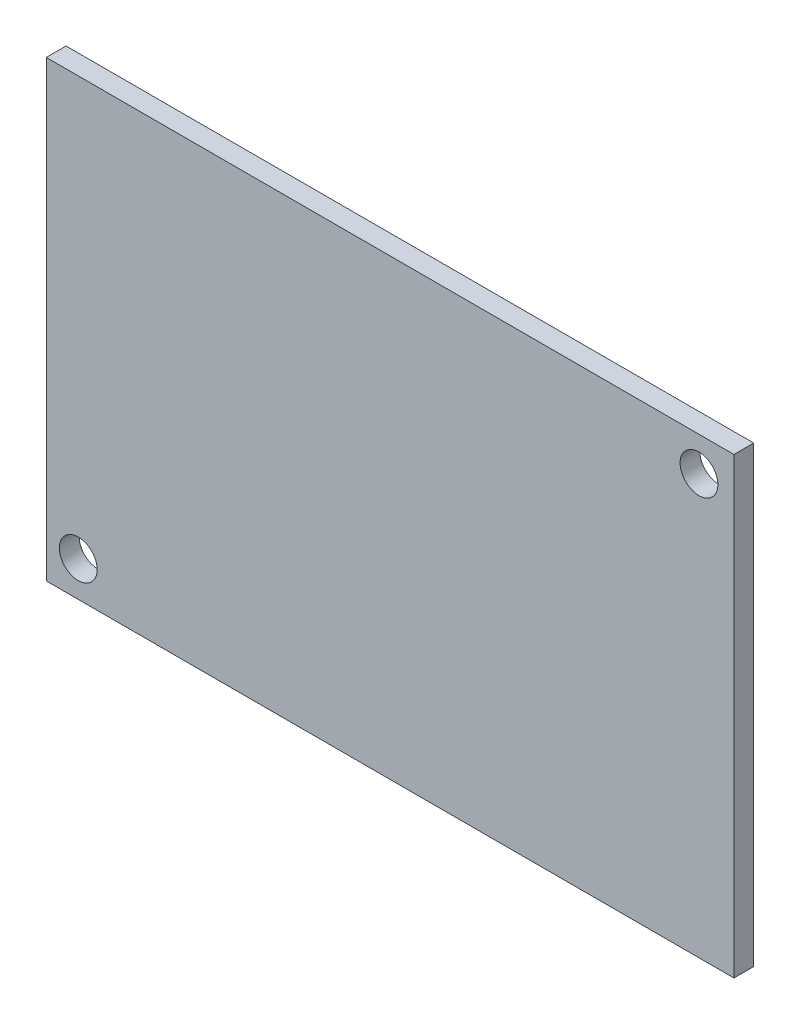
ISO-10303-21;
HEADER;
FILE_DESCRIPTION(('STEP AP214'),'2;1');
FILE_NAME('part.step','',(''),(''),'','','');
FILE_SCHEMA(('AUTOMOTIVE_DESIGN { 1 0 10303 214 1 1 1 1 }'));
ENDSEC;
DATA;
#1=APPLICATION_CONTEXT('core data for automotive mechanical design processes');
#2=APPLICATION_PROTOCOL_DEFINITION('international standard','automotive_design',2000,#1);
#3=PRODUCT_CONTEXT('',#1,'mechanical');
#4=PRODUCT('Part','Part','',(#3));
#5=PRODUCT_RELATED_PRODUCT_CATEGORY('part','',(#4));
#6=PRODUCT_DEFINITION_FORMATION('','',#4);
#7=PRODUCT_DEFINITION_CONTEXT('part definition',#1,'design');
#8=PRODUCT_DEFINITION('design','',#6,#7);
#9=PRODUCT_DEFINITION_SHAPE('','',#8);
#10=(LENGTH_UNIT() NAMED_UNIT(*) SI_UNIT(.MILLI.,.METRE.));
#11=(NAMED_UNIT(*) PLANE_ANGLE_UNIT() SI_UNIT($,.RADIAN.));
#12=(NAMED_UNIT(*) SI_UNIT($,.STERADIAN.) SOLID_ANGLE_UNIT());
#13=UNCERTAINTY_MEASURE_WITH_UNIT(LENGTH_MEASURE(1.E-05),#10,'distance_accuracy_value','');
#14=(GEOMETRIC_REPRESENTATION_CONTEXT(3) GLOBAL_UNCERTAINTY_ASSIGNED_CONTEXT((#13)) GLOBAL_UNIT_ASSIGNED_CONTEXT((#10,
#11,#12)) REPRESENTATION_CONTEXT('',''));
#15=CARTESIAN_POINT('',(0.,0.,0.));
#16=DIRECTION('',(0.,0.,1.));
#17=DIRECTION('',(1.,0.,0.));
#18=AXIS2_PLACEMENT_3D('',#15,#16,#17);
#19=CARTESIAN_POINT('',(0.762,0.,1.57));
#20=DIRECTION('',(0.,0.,-1.));
#21=DIRECTION('',(-1.,0.,0.));
#22=AXIS2_PLACEMENT_3D('',#19,#20,#21);
#23=PLANE('',#22);
#24=CARTESIAN_POINT('',(52.578,33.274,1.57));
#25=DIRECTION('',(0.,0.,-1.));
#26=DIRECTION('',(-1.,0.,0.));
#27=AXIS2_PLACEMENT_3D('',#24,#25,#26);
#28=CIRCLE('',#27,1.5);
#29=CARTESIAN_POINT('',(51.078,33.274,1.57));
#30=VERTEX_POINT('',#29);
#31=EDGE_CURVE('E84',#30,#30,#28,.T.);
#32=ORIENTED_EDGE('',*,*,#31,.T.);
#33=EDGE_LOOP('',(#32));
#34=FACE_BOUND('',#33,.T.);
#35=CARTESIAN_POINT('',(3.302,2.794,1.57));
#36=DIRECTION('',(0.,0.,-1.));
#37=DIRECTION('',(-1.,0.,0.));
#38=AXIS2_PLACEMENT_3D('',#35,#36,#37);
#39=CIRCLE('',#38,1.5);
#40=CARTESIAN_POINT('',(1.802,2.794,1.57));
#41=VERTEX_POINT('',#40);
#42=EDGE_CURVE('E20',#41,#41,#39,.T.);
#43=ORIENTED_EDGE('',*,*,#42,.T.);
#44=EDGE_LOOP('',(#43));
#45=FACE_BOUND('',#44,.T.);
#46=DIRECTION('',(0.,1.,0.));
#47=VECTOR('',#46,1.);
#48=CARTESIAN_POINT('',(55.352,0.,1.57));
#49=LINE('',#48,#47);
#50=CARTESIAN_POINT('',(55.352,0.,1.57));
#51=VERTEX_POINT('',#50);
#52=CARTESIAN_POINT('',(55.352,35.992,1.57));
#53=VERTEX_POINT('',#52);
#54=EDGE_CURVE('E55',#51,#53,#49,.T.);
#55=ORIENTED_EDGE('',*,*,#54,.T.);
#56=DIRECTION('',(1.,0.,0.));
#57=VECTOR('',#56,1.);
#58=CARTESIAN_POINT('',(55.352,35.992,1.57));
#59=LINE('',#58,#57);
#60=CARTESIAN_POINT('',(0.762,35.992,1.57));
#61=VERTEX_POINT('',#60);
#62=EDGE_CURVE('E57',#53,#61,#59,.F.);
#63=ORIENTED_EDGE('',*,*,#62,.T.);
#64=DIRECTION('',(0.,1.,0.));
#65=VECTOR('',#64,1.);
#66=CARTESIAN_POINT('',(0.762,35.992,1.57));
#67=LINE('',#66,#65);
#68=CARTESIAN_POINT('',(0.762,0.,1.57));
#69=VERTEX_POINT('',#68);
#70=EDGE_CURVE('E59',#61,#69,#67,.F.);
#71=ORIENTED_EDGE('',*,*,#70,.T.);
#72=DIRECTION('',(1.,0.,0.));
#73=VECTOR('',#72,1.);
#74=CARTESIAN_POINT('',(0.762,0.,1.57));
#75=LINE('',#74,#73);
#76=EDGE_CURVE('E93',#69,#51,#75,.T.);
#77=ORIENTED_EDGE('',*,*,#76,.T.);
#78=EDGE_LOOP('',(#55,#63,#71,#77));
#79=FACE_BOUND('',#78,.T.);
#80=ADVANCED_FACE('F17',(#34,#45,#79),#23,.F.);
#81=CARTESIAN_POINT('',(0.762,35.992,0.));
#82=DIRECTION('',(1.,0.,0.));
#83=DIRECTION('',(0.,0.,-1.));
#84=AXIS2_PLACEMENT_3D('',#81,#82,#83);
#85=PLANE('',#84);
#86=DIRECTION('',(0.,0.,1.));
#87=VECTOR('',#86,1.);
#88=CARTESIAN_POINT('',(0.762,0.,0.));
#89=LINE('',#88,#87);
#90=CARTESIAN_POINT('',(0.762,0.,0.));
#91=VERTEX_POINT('',#90);
#92=EDGE_CURVE('E70',#91,#69,#89,.T.);
#93=ORIENTED_EDGE('',*,*,#92,.T.);
#94=ORIENTED_EDGE('',*,*,#70,.F.);
#95=DIRECTION('',(0.,0.,-1.));
#96=VECTOR('',#95,1.);
#97=CARTESIAN_POINT('',(0.761999999999999,35.992,0.));
#98=LINE('',#97,#96);
#99=CARTESIAN_POINT('',(0.762,35.992,0.));
#100=VERTEX_POINT('',#99);
#101=EDGE_CURVE('E64',#61,#100,#98,.T.);
#102=ORIENTED_EDGE('',*,*,#101,.T.);
#103=DIRECTION('',(0.,1.,0.));
#104=VECTOR('',#103,1.);
#105=CARTESIAN_POINT('',(0.762,0.,0.));
#106=LINE('',#105,#104);
#107=EDGE_CURVE('E86',#91,#100,#106,.T.);
#108=ORIENTED_EDGE('',*,*,#107,.F.);
#109=EDGE_LOOP('',(#93,#94,#102,#108));
#110=FACE_BOUND('',#109,.T.);
#111=ADVANCED_FACE('F67',(#110),#85,.F.);
#112=CARTESIAN_POINT('',(55.352,35.992,0.));
#113=DIRECTION('',(0.,-1.,0.));
#114=DIRECTION('',(0.,0.,-1.));
#115=AXIS2_PLACEMENT_3D('',#112,#113,#114);
#116=PLANE('',#115);
#117=ORIENTED_EDGE('',*,*,#101,.F.);
#118=ORIENTED_EDGE('',*,*,#62,.F.);
#119=DIRECTION('',(0.,0.,1.));
#120=VECTOR('',#119,1.);
#121=CARTESIAN_POINT('',(55.352,35.992,0.));
#122=LINE('',#121,#120);
#123=CARTESIAN_POINT('',(55.352,35.992,0.));
#124=VERTEX_POINT('',#123);
#125=EDGE_CURVE('E78',#53,#124,#122,.F.);
#126=ORIENTED_EDGE('',*,*,#125,.T.);
#127=DIRECTION('',(-1.,0.,0.));
#128=VECTOR('',#127,1.);
#129=CARTESIAN_POINT('',(0.762,35.992,0.));
#130=LINE('',#129,#128);
#131=EDGE_CURVE('E75',#100,#124,#130,.F.);
#132=ORIENTED_EDGE('',*,*,#131,.F.);
#133=EDGE_LOOP('',(#117,#118,#126,#132));
#134=FACE_BOUND('',#133,.T.);
#135=ADVANCED_FACE('F73',(#134),#116,.F.);
#136=CARTESIAN_POINT('',(55.352,0.,0.));
#137=DIRECTION('',(-1.,0.,0.));
#138=DIRECTION('',(0.,0.,1.));
#139=AXIS2_PLACEMENT_3D('',#136,#137,#138);
#140=PLANE('',#139);
#141=ORIENTED_EDGE('',*,*,#125,.F.);
#142=ORIENTED_EDGE('',*,*,#54,.F.);
#143=DIRECTION('',(0.,0.,1.));
#144=VECTOR('',#143,1.);
#145=CARTESIAN_POINT('',(55.352,0.,0.));
#146=LINE('',#145,#144);
#147=CARTESIAN_POINT('',(55.352,0.,0.));
#148=VERTEX_POINT('',#147);
#149=EDGE_CURVE('E35',#51,#148,#146,.F.);
#150=ORIENTED_EDGE('',*,*,#149,.T.);
#151=DIRECTION('',(0.,1.,0.));
#152=VECTOR('',#151,1.);
#153=CARTESIAN_POINT('',(55.352,0.,0.));
#154=LINE('',#153,#152);
#155=EDGE_CURVE('E99',#124,#148,#154,.F.);
#156=ORIENTED_EDGE('',*,*,#155,.F.);
#157=EDGE_LOOP('',(#141,#142,#150,#156));
#158=FACE_BOUND('',#157,.T.);
#159=ADVANCED_FACE('F100',(#158),#140,.F.);
#160=CARTESIAN_POINT('',(0.762,0.,0.));
#161=DIRECTION('',(0.,1.,0.));
#162=DIRECTION('',(0.,0.,1.));
#163=AXIS2_PLACEMENT_3D('',#160,#161,#162);
#164=PLANE('',#163);
#165=ORIENTED_EDGE('',*,*,#149,.F.);
#166=ORIENTED_EDGE('',*,*,#76,.F.);
#167=ORIENTED_EDGE('',*,*,#92,.F.);
#168=DIRECTION('',(-1.,0.,0.));
#169=VECTOR('',#168,1.);
#170=CARTESIAN_POINT('',(0.762,0.,0.));
#171=LINE('',#170,#169);
#172=EDGE_CURVE('E83',#148,#91,#171,.T.);
#173=ORIENTED_EDGE('',*,*,#172,.F.);
#174=EDGE_LOOP('',(#165,#166,#167,#173));
#175=FACE_BOUND('',#174,.T.);
#176=ADVANCED_FACE('F107',(#175),#164,.F.);
#177=CARTESIAN_POINT('',(3.302,2.794,0.));
#178=DIRECTION('',(0.,0.,-1.));
#179=DIRECTION('',(-1.,0.,0.));
#180=AXIS2_PLACEMENT_3D('',#177,#178,#179);
#181=CYLINDRICAL_SURFACE('',#180,1.5);
#182=ORIENTED_EDGE('',*,*,#42,.F.);
#183=EDGE_LOOP('',(#182));
#184=FACE_BOUND('',#183,.T.);
#185=CARTESIAN_POINT('',(3.302,2.794,0.));
#186=DIRECTION('',(0.,0.,-1.));
#187=DIRECTION('',(-1.,0.,0.));
#188=AXIS2_PLACEMENT_3D('',#185,#186,#187);
#189=CIRCLE('',#188,1.5);
#190=CARTESIAN_POINT('',(1.802,2.794,0.));
#191=VERTEX_POINT('',#190);
#192=EDGE_CURVE('E26',#191,#191,#189,.F.);
#193=ORIENTED_EDGE('',*,*,#192,.F.);
#194=EDGE_LOOP('',(#193));
#195=FACE_BOUND('',#194,.T.);
#196=ADVANCED_FACE('F109',(#184,#195),#181,.F.);
#197=CARTESIAN_POINT('',(52.578,33.274,0.));
#198=DIRECTION('',(0.,0.,-1.));
#199=DIRECTION('',(-1.,0.,0.));
#200=AXIS2_PLACEMENT_3D('',#197,#198,#199);
#201=CYLINDRICAL_SURFACE('',#200,1.5);
#202=ORIENTED_EDGE('',*,*,#31,.F.);
#203=EDGE_LOOP('',(#202));
#204=FACE_BOUND('',#203,.T.);
#205=CARTESIAN_POINT('',(52.578,33.274,0.));
#206=DIRECTION('',(0.,0.,-1.));
#207=DIRECTION('',(-1.,0.,0.));
#208=AXIS2_PLACEMENT_3D('',#205,#206,#207);
#209=CIRCLE('',#208,1.5);
#210=CARTESIAN_POINT('',(51.078,33.274,0.));
#211=VERTEX_POINT('',#210);
#212=EDGE_CURVE('E11',#211,#211,#209,.F.);
#213=ORIENTED_EDGE('',*,*,#212,.F.);
#214=EDGE_LOOP('',(#213));
#215=FACE_BOUND('',#214,.T.);
#216=ADVANCED_FACE('F116',(#204,#215),#201,.F.);
#217=CARTESIAN_POINT('',(0.762,0.,0.));
#218=DIRECTION('',(0.,0.,-1.));
#219=DIRECTION('',(-1.,0.,0.));
#220=AXIS2_PLACEMENT_3D('',#217,#218,#219);
#221=PLANE('',#220);
#222=ORIENTED_EDGE('',*,*,#212,.T.);
#223=EDGE_LOOP('',(#222));
#224=FACE_BOUND('',#223,.T.);
#225=ORIENTED_EDGE('',*,*,#192,.T.);
#226=EDGE_LOOP('',(#225));
#227=FACE_BOUND('',#226,.T.);
#228=ORIENTED_EDGE('',*,*,#155,.T.);
#229=ORIENTED_EDGE('',*,*,#172,.T.);
#230=ORIENTED_EDGE('',*,*,#107,.T.);
#231=ORIENTED_EDGE('',*,*,#131,.T.);
#232=EDGE_LOOP('',(#228,#229,#230,#231));
#233=FACE_BOUND('',#232,.T.);
#234=ADVANCED_FACE('F104',(#224,#227,#233),#221,.T.);
#235=CLOSED_SHELL('',(#80,#111,#135,#159,#176,#196,#216,#234));
#236=MANIFOLD_SOLID_BREP('B1',#235);
#237=ADVANCED_BREP_SHAPE_REPRESENTATION('',(#18,#236),#14);
#238=SHAPE_DEFINITION_REPRESENTATION(#9,#237);
ENDSEC;
END-ISO-10303-21;
